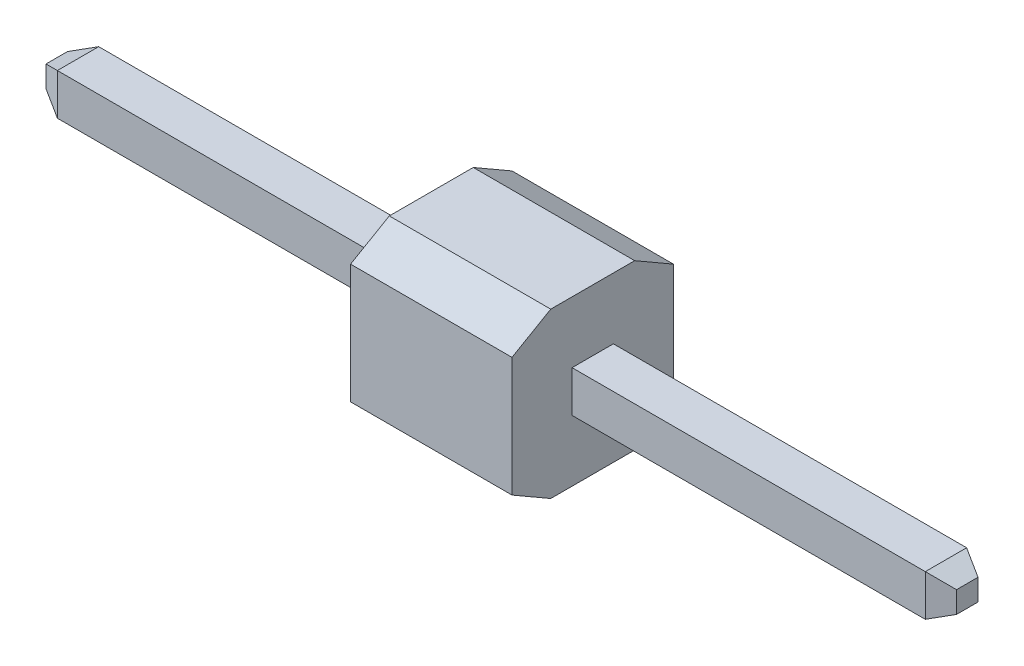
ISO-10303-21;
HEADER;
FILE_DESCRIPTION(('STEP AP214'),'2;1');
FILE_NAME('part.step','',(''),(''),'','','');
FILE_SCHEMA(('AUTOMOTIVE_DESIGN { 1 0 10303 214 1 1 1 1 }'));
ENDSEC;
DATA;
#1=APPLICATION_CONTEXT('core data for automotive mechanical design processes');
#2=APPLICATION_PROTOCOL_DEFINITION('international standard','automotive_design',2000,#1);
#3=PRODUCT_CONTEXT('',#1,'mechanical');
#4=PRODUCT('Part','Part','',(#3));
#5=PRODUCT_RELATED_PRODUCT_CATEGORY('part','',(#4));
#6=PRODUCT_DEFINITION_FORMATION('','',#4);
#7=PRODUCT_DEFINITION_CONTEXT('part definition',#1,'design');
#8=PRODUCT_DEFINITION('design','',#6,#7);
#9=PRODUCT_DEFINITION_SHAPE('','',#8);
#10=(LENGTH_UNIT() NAMED_UNIT(*) SI_UNIT(.MILLI.,.METRE.));
#11=(NAMED_UNIT(*) PLANE_ANGLE_UNIT() SI_UNIT($,.RADIAN.));
#12=(NAMED_UNIT(*) SI_UNIT($,.STERADIAN.) SOLID_ANGLE_UNIT());
#13=UNCERTAINTY_MEASURE_WITH_UNIT(LENGTH_MEASURE(1.E-05),#10,'distance_accuracy_value','');
#14=(GEOMETRIC_REPRESENTATION_CONTEXT(3) GLOBAL_UNCERTAINTY_ASSIGNED_CONTEXT((#13)) GLOBAL_UNIT_ASSIGNED_CONTEXT((#10,
#11,#12)) REPRESENTATION_CONTEXT('',''));
#15=CARTESIAN_POINT('',(0.,0.,0.));
#16=DIRECTION('',(0.,0.,1.));
#17=DIRECTION('',(1.,0.,0.));
#18=AXIS2_PLACEMENT_3D('',#15,#16,#17);
#19=CARTESIAN_POINT('',(5.42107472349216,4.76287173708609,0.629998634255617));
#20=DIRECTION('',(1.,4.37113882867379E-08,-4.37113882867379E-08));
#21=DIRECTION('',(-4.37113882867379E-08,1.,0.));
#22=AXIS2_PLACEMENT_3D('',#19,#20,#21);
#23=PLANE('',#22);
#24=DIRECTION('',(1.59994790123753E-08,0.50000000000019,0.866025403784329));
#25=VECTOR('',#24,1.);
#26=CARTESIAN_POINT('',(5.42107460050624,6.00646157557209,-0.940001365744382));
#27=LINE('',#26,#25);
#28=CARTESIAN_POINT('',(5.42107460050624,6.00646157557209,-0.940001365744382));
#29=VERTEX_POINT('',#28);
#30=CARTESIAN_POINT('',(5.421074611591,6.35287173708609,-0.340001365744383));
#31=VERTEX_POINT('',#30);
#32=EDGE_CURVE('E11',#29,#31,#27,.T.);
#33=ORIENTED_EDGE('',*,*,#32,.T.);
#34=DIRECTION('',(4.37113886966664E-08,0.,0.999999999999999));
#35=VECTOR('',#34,1.);
#36=CARTESIAN_POINT('',(5.421074611591,6.35287173708609,-0.340001365744383));
#37=LINE('',#36,#35);
#38=CARTESIAN_POINT('',(5.42107466841581,6.35287173708609,0.959998634255618));
#39=VERTEX_POINT('',#38);
#40=EDGE_CURVE('E304',#31,#39,#37,.T.);
#41=ORIENTED_EDGE('',*,*,#40,.T.);
#42=DIRECTION('',(5.97108656004285E-08,-0.500000000000189,0.866025403784328));
#43=VECTOR('',#42,1.);
#44=CARTESIAN_POINT('',(5.42107466841581,6.35287173708609,0.959998634255618));
#45=LINE('',#44,#43);
#46=CARTESIAN_POINT('',(5.42107470978471,6.00646157557209,1.55999863425562));
#47=VERTEX_POINT('',#46);
#48=EDGE_CURVE('E296',#39,#47,#45,.T.);
#49=ORIENTED_EDGE('',*,*,#48,.T.);
#50=DIRECTION('',(4.37113884815072E-08,-0.999999999999999,0.));
#51=VECTOR('',#50,1.);
#52=CARTESIAN_POINT('',(5.42107470978471,6.00646157557209,1.55999863425562));
#53=LINE('',#52,#51);
#54=CARTESIAN_POINT('',(5.4210747905275,4.15928189860009,1.55999863425562));
#55=VERTEX_POINT('',#54);
#56=EDGE_CURVE('E281',#47,#55,#53,.T.);
#57=ORIENTED_EDGE('',*,*,#56,.T.);
#58=DIRECTION('',(1.59994790123752E-08,0.500000000000192,0.866025403784328));
#59=VECTOR('',#58,1.);
#60=CARTESIAN_POINT('',(5.42107477944273,3.81287173708609,0.959998634255618));
#61=LINE('',#60,#59);
#62=CARTESIAN_POINT('',(5.42107477944273,3.81287173708609,0.959998634255618));
#63=VERTEX_POINT('',#62);
#64=EDGE_CURVE('E265',#63,#55,#61,.T.);
#65=ORIENTED_EDGE('',*,*,#64,.F.);
#66=DIRECTION('',(4.37113880134522E-08,0.,0.999999999999999));
#67=VECTOR('',#66,1.);
#68=CARTESIAN_POINT('',(5.42107472261793,3.81287173708609,-0.340001365744383));
#69=LINE('',#68,#67);
#70=CARTESIAN_POINT('',(5.42107472261793,3.81287173708609,-0.340001365744383));
#71=VERTEX_POINT('',#70);
#72=EDGE_CURVE('E248',#71,#63,#69,.T.);
#73=ORIENTED_EDGE('',*,*,#72,.F.);
#74=DIRECTION('',(5.97108668824036E-08,-0.500000000000187,0.866025403784328));
#75=VECTOR('',#74,1.);
#76=CARTESIAN_POINT('',(5.42107468124903,4.15928189860008,-0.940001365744382));
#77=LINE('',#76,#75);
#78=CARTESIAN_POINT('',(5.42107468124903,4.15928189860008,-0.940001365744382));
#79=VERTEX_POINT('',#78);
#80=EDGE_CURVE('E242',#79,#71,#77,.T.);
#81=ORIENTED_EDGE('',*,*,#80,.F.);
#82=DIRECTION('',(4.37113884815072E-08,-0.999999999999999,0.));
#83=VECTOR('',#82,1.);
#84=CARTESIAN_POINT('',(5.42107460050624,6.00646157557209,-0.940001365744382));
#85=LINE('',#84,#83);
#86=EDGE_CURVE('E236',#29,#79,#85,.T.);
#87=ORIENTED_EDGE('',*,*,#86,.F.);
#88=EDGE_LOOP('',(#33,#41,#49,#57,#65,#73,#81,#87));
#89=FACE_BOUND('',#88,.T.);
#90=DIRECTION('',(-4.37113886753159E-08,0.,-0.999999999999999));
#91=VECTOR('',#90,1.);
#92=CARTESIAN_POINT('',(5.42107469551687,5.40287173708609,0.629998634255617));
#93=LINE('',#92,#91);
#94=CARTESIAN_POINT('',(5.42107469551687,5.40287173708609,0.629998634255617));
#95=VERTEX_POINT('',#94);
#96=CARTESIAN_POINT('',(5.42107466754158,5.40287173708609,-0.0100013657443826));
#97=VERTEX_POINT('',#96);
#98=EDGE_CURVE('E302',#95,#97,#93,.T.);
#99=ORIENTED_EDGE('',*,*,#98,.T.);
#100=DIRECTION('',(-4.3711388675316E-08,0.999999999999999,0.));
#101=VECTOR('',#100,1.);
#102=CARTESIAN_POINT('',(5.42107469551687,4.76287173708609,-0.0100013657443826));
#103=LINE('',#102,#101);
#104=CARTESIAN_POINT('',(5.42107469551687,4.76287173708609,-0.0100013657443826));
#105=VERTEX_POINT('',#104);
#106=EDGE_CURVE('E293',#105,#97,#103,.T.);
#107=ORIENTED_EDGE('',*,*,#106,.F.);
#108=DIRECTION('',(-4.37113886753159E-08,0.,-0.999999999999999));
#109=VECTOR('',#108,1.);
#110=CARTESIAN_POINT('',(5.42107472349216,4.76287173708609,0.629998634255617));
#111=LINE('',#110,#109);
#112=CARTESIAN_POINT('',(5.42107472349216,4.76287173708609,0.629998634255617));
#113=VERTEX_POINT('',#112);
#114=EDGE_CURVE('E278',#113,#105,#111,.T.);
#115=ORIENTED_EDGE('',*,*,#114,.F.);
#116=DIRECTION('',(-4.3711388675316E-08,0.999999999999999,0.));
#117=VECTOR('',#116,1.);
#118=CARTESIAN_POINT('',(5.42107472349216,4.76287173708609,0.629998634255617));
#119=LINE('',#118,#117);
#120=EDGE_CURVE('E263',#113,#95,#119,.T.);
#121=ORIENTED_EDGE('',*,*,#120,.T.);
#122=EDGE_LOOP('',(#99,#107,#115,#121));
#123=FACE_BOUND('',#122,.T.);
#124=ADVANCED_FACE('F17',(#89,#123),#23,.T.);
#125=CARTESIAN_POINT('',(2.92107472349216,4.76287162780762,0.629998743534088));
#126=DIRECTION('',(1.,4.37113882867379E-08,-4.37113882867379E-08));
#127=DIRECTION('',(-4.37113882867379E-08,1.,0.));
#128=AXIS2_PLACEMENT_3D('',#125,#126,#127);
#129=PLANE('',#128);
#130=DIRECTION('',(1.59994790123753E-08,0.50000000000019,0.866025403784329));
#131=VECTOR('',#130,1.);
#132=CARTESIAN_POINT('',(2.92107460050624,6.00646146629361,-0.940001256465912));
#133=LINE('',#132,#131);
#134=CARTESIAN_POINT('',(2.92107460050624,6.00646146629361,-0.940001256465912));
#135=VERTEX_POINT('',#134);
#136=CARTESIAN_POINT('',(2.921074611591,6.35287162780762,-0.340001256465912));
#137=VERTEX_POINT('',#136);
#138=EDGE_CURVE('E24',#135,#137,#133,.T.);
#139=ORIENTED_EDGE('',*,*,#138,.F.);
#140=DIRECTION('',(4.37113884815072E-08,-0.999999999999999,0.));
#141=VECTOR('',#140,1.);
#142=CARTESIAN_POINT('',(2.92107460050624,6.00646146629361,-0.940001256465912));
#143=LINE('',#142,#141);
#144=CARTESIAN_POINT('',(2.92107468124903,4.15928178932161,-0.940001256465912));
#145=VERTEX_POINT('',#144);
#146=EDGE_CURVE('E300',#135,#145,#143,.T.);
#147=ORIENTED_EDGE('',*,*,#146,.T.);
#148=DIRECTION('',(5.97108668824036E-08,-0.500000000000187,0.866025403784328));
#149=VECTOR('',#148,1.);
#150=CARTESIAN_POINT('',(2.92107468124903,4.15928178932161,-0.940001256465912));
#151=LINE('',#150,#149);
#152=CARTESIAN_POINT('',(2.92107472261793,3.81287162780762,-0.340001256465912));
#153=VERTEX_POINT('',#152);
#154=EDGE_CURVE('E286',#145,#153,#151,.T.);
#155=ORIENTED_EDGE('',*,*,#154,.T.);
#156=DIRECTION('',(4.37113880134522E-08,0.,0.999999999999999));
#157=VECTOR('',#156,1.);
#158=CARTESIAN_POINT('',(2.92107472261793,3.81287162780762,-0.340001256465912));
#159=LINE('',#158,#157);
#160=CARTESIAN_POINT('',(2.92107477944273,3.81287162780762,0.959998743534088));
#161=VERTEX_POINT('',#160);
#162=EDGE_CURVE('E271',#153,#161,#159,.T.);
#163=ORIENTED_EDGE('',*,*,#162,.T.);
#164=DIRECTION('',(1.59994790123752E-08,0.500000000000192,0.866025403784328));
#165=VECTOR('',#164,1.);
#166=CARTESIAN_POINT('',(2.92107477944273,3.81287162780762,0.959998743534088));
#167=LINE('',#166,#165);
#168=CARTESIAN_POINT('',(2.9210747905275,4.15928178932162,1.55999874353409));
#169=VERTEX_POINT('',#168);
#170=EDGE_CURVE('E253',#161,#169,#167,.T.);
#171=ORIENTED_EDGE('',*,*,#170,.T.);
#172=DIRECTION('',(4.37113884815072E-08,-0.999999999999999,0.));
#173=VECTOR('',#172,1.);
#174=CARTESIAN_POINT('',(2.92107470978471,6.00646146629362,1.55999874353409));
#175=LINE('',#174,#173);
#176=CARTESIAN_POINT('',(2.92107470978471,6.00646146629362,1.55999874353409));
#177=VERTEX_POINT('',#176);
#178=EDGE_CURVE('E261',#177,#169,#175,.T.);
#179=ORIENTED_EDGE('',*,*,#178,.F.);
#180=DIRECTION('',(5.9710866241416E-08,-0.500000000000189,0.866025403784328));
#181=VECTOR('',#180,1.);
#182=CARTESIAN_POINT('',(2.92107466841581,6.35287162780762,0.959998743534088));
#183=LINE('',#182,#181);
#184=CARTESIAN_POINT('',(2.92107466841581,6.35287162780762,0.959998743534088));
#185=VERTEX_POINT('',#184);
#186=EDGE_CURVE('E276',#185,#177,#183,.T.);
#187=ORIENTED_EDGE('',*,*,#186,.F.);
#188=DIRECTION('',(4.37113883550593E-08,0.,0.999999999999999));
#189=VECTOR('',#188,1.);
#190=CARTESIAN_POINT('',(2.921074611591,6.35287162780762,-0.340001256465912));
#191=LINE('',#190,#189);
#192=EDGE_CURVE('E291',#137,#185,#191,.T.);
#193=ORIENTED_EDGE('',*,*,#192,.F.);
#194=EDGE_LOOP('',(#139,#147,#155,#163,#171,#179,#187,#193));
#195=FACE_BOUND('',#194,.T.);
#196=DIRECTION('',(-4.37113879814266E-08,0.999999999999999,0.));
#197=VECTOR('',#196,1.);
#198=CARTESIAN_POINT('',(2.92107469551687,4.76287162780762,-0.0100012564659119));
#199=LINE('',#198,#197);
#200=CARTESIAN_POINT('',(2.92107469551687,4.76287162780762,-0.0100012564659119));
#201=VERTEX_POINT('',#200);
#202=CARTESIAN_POINT('',(2.92107466754158,5.40287162780762,-0.0100012564659119));
#203=VERTEX_POINT('',#202);
#204=EDGE_CURVE('E298',#201,#203,#199,.T.);
#205=ORIENTED_EDGE('',*,*,#204,.T.);
#206=DIRECTION('',(-4.37113879814266E-08,0.,-0.999999999999999));
#207=VECTOR('',#206,1.);
#208=CARTESIAN_POINT('',(2.92107469551687,5.40287162780762,0.629998743534088));
#209=LINE('',#208,#207);
#210=CARTESIAN_POINT('',(2.92107469551687,5.40287162780762,0.629998743534088));
#211=VERTEX_POINT('',#210);
#212=EDGE_CURVE('E283',#211,#203,#209,.T.);
#213=ORIENTED_EDGE('',*,*,#212,.F.);
#214=DIRECTION('',(-4.3711388675316E-08,0.999999999999999,0.));
#215=VECTOR('',#214,1.);
#216=CARTESIAN_POINT('',(2.92107472349216,4.76287162780762,0.629998743534088));
#217=LINE('',#216,#215);
#218=CARTESIAN_POINT('',(2.92107472349216,4.76287162780762,0.629998743534088));
#219=VERTEX_POINT('',#218);
#220=EDGE_CURVE('E268',#219,#211,#217,.T.);
#221=ORIENTED_EDGE('',*,*,#220,.F.);
#222=DIRECTION('',(-4.37113886753159E-08,0.,-0.999999999999999));
#223=VECTOR('',#222,1.);
#224=CARTESIAN_POINT('',(2.92107472349216,4.76287162780762,0.629998743534088));
#225=LINE('',#224,#223);
#226=EDGE_CURVE('E251',#219,#201,#225,.T.);
#227=ORIENTED_EDGE('',*,*,#226,.T.);
#228=EDGE_LOOP('',(#205,#213,#221,#227));
#229=FACE_BOUND('',#228,.T.);
#230=ADVANCED_FACE('F314',(#195,#229),#129,.F.);
#231=CARTESIAN_POINT('',(5.42107460050624,6.00646157557209,-0.940001365744382));
#232=DIRECTION('',(5.97108668343731E-08,-0.866025403784328,0.50000000000019));
#233=DIRECTION('',(-1.59994785476185E-08,-0.500000000000192,-0.866025403784329));
#234=AXIS2_PLACEMENT_3D('',#231,#232,#233);
#235=PLANE('',#234);
#236=ORIENTED_EDGE('',*,*,#138,.T.);
#237=DIRECTION('',(-0.999999999999998,-4.37113886420092E-08,4.37113883755557E-08));
#238=VECTOR('',#237,1.);
#239=CARTESIAN_POINT('',(5.421074611591,6.35287173708609,-0.340001365744383));
#240=LINE('',#239,#238);
#241=EDGE_CURVE('E288',#31,#137,#240,.T.);
#242=ORIENTED_EDGE('',*,*,#241,.F.);
#243=ORIENTED_EDGE('',*,*,#32,.F.);
#244=DIRECTION('',(-0.999999999999998,-4.37113889972806E-08,4.37113881091022E-08));
#245=VECTOR('',#244,1.);
#246=CARTESIAN_POINT('',(5.42107460050624,6.00646157557209,-0.940001365744382));
#247=LINE('',#246,#245);
#248=EDGE_CURVE('E256',#29,#135,#247,.T.);
#249=ORIENTED_EDGE('',*,*,#248,.T.);
#250=EDGE_LOOP('',(#236,#242,#243,#249));
#251=FACE_BOUND('',#250,.T.);
#252=ADVANCED_FACE('F306',(#251),#235,.F.);
#253=CARTESIAN_POINT('',(5.421074611591,6.35287173708609,-0.340001365744383));
#254=DIRECTION('',(4.37113882867379E-08,-1.,0.));
#255=DIRECTION('',(1.,4.37113882867379E-08,-4.37113882867379E-08));
#256=AXIS2_PLACEMENT_3D('',#253,#254,#255);
#257=PLANE('',#256);
#258=ORIENTED_EDGE('',*,*,#192,.T.);
#259=DIRECTION('',(-0.999999999999998,-4.37113886420092E-08,4.37113882867378E-08));
#260=VECTOR('',#259,1.);
#261=CARTESIAN_POINT('',(5.42107466841581,6.35287173708609,0.959998634255618));
#262=LINE('',#261,#260);
#263=EDGE_CURVE('E273',#39,#185,#262,.T.);
#264=ORIENTED_EDGE('',*,*,#263,.F.);
#265=ORIENTED_EDGE('',*,*,#40,.F.);
#266=ORIENTED_EDGE('',*,*,#241,.T.);
#267=EDGE_LOOP('',(#258,#264,#265,#266));
#268=FACE_BOUND('',#267,.T.);
#269=ADVANCED_FACE('F311',(#268),#257,.F.);
#270=CARTESIAN_POINT('',(5.42107466841581,6.35287173708609,0.959998634255618));
#271=DIRECTION('',(1.59994785476185E-08,-0.86602540378433,-0.50000000000019));
#272=DIRECTION('',(-5.97108668343731E-08,0.500000000000188,-0.866025403784329));
#273=AXIS2_PLACEMENT_3D('',#270,#271,#272);
#274=PLANE('',#273);
#275=ORIENTED_EDGE('',*,*,#186,.T.);
#276=DIRECTION('',(-0.999999999999998,-4.37113889972806E-08,4.37113882867378E-08));
#277=VECTOR('',#276,1.);
#278=CARTESIAN_POINT('',(5.42107470978471,6.00646157557209,1.55999863425562));
#279=LINE('',#278,#277);
#280=EDGE_CURVE('E258',#47,#177,#279,.T.);
#281=ORIENTED_EDGE('',*,*,#280,.F.);
#282=ORIENTED_EDGE('',*,*,#48,.F.);
#283=ORIENTED_EDGE('',*,*,#263,.T.);
#284=EDGE_LOOP('',(#275,#281,#282,#283));
#285=FACE_BOUND('',#284,.T.);
#286=ADVANCED_FACE('F319',(#285),#274,.F.);
#287=CARTESIAN_POINT('',(5.42107470978471,6.00646157557209,1.55999863425562));
#288=DIRECTION('',(-4.37113882867379E-08,0.,-1.));
#289=DIRECTION('',(-1.,-4.37113882867379E-08,4.37113882867379E-08));
#290=AXIS2_PLACEMENT_3D('',#287,#288,#289);
#291=PLANE('',#290);
#292=ORIENTED_EDGE('',*,*,#178,.T.);
#293=DIRECTION('',(-0.999999999999998,-4.37113882867378E-08,4.37113882867378E-08));
#294=VECTOR('',#293,1.);
#295=CARTESIAN_POINT('',(5.4210747905275,4.15928189860009,1.55999863425562));
#296=LINE('',#295,#294);
#297=EDGE_CURVE('E245',#55,#169,#296,.T.);
#298=ORIENTED_EDGE('',*,*,#297,.F.);
#299=ORIENTED_EDGE('',*,*,#56,.F.);
#300=ORIENTED_EDGE('',*,*,#280,.T.);
#301=EDGE_LOOP('',(#292,#298,#299,#300));
#302=FACE_BOUND('',#301,.T.);
#303=ADVANCED_FACE('F326',(#302),#291,.F.);
#304=CARTESIAN_POINT('',(5.42107477944273,3.81287173708609,0.959998634255618));
#305=DIRECTION('',(5.97108668343731E-08,-0.866025403784328,0.50000000000019));
#306=DIRECTION('',(-1.59994785476185E-08,-0.500000000000192,-0.866025403784329));
#307=AXIS2_PLACEMENT_3D('',#304,#305,#306);
#308=PLANE('',#307);
#309=ORIENTED_EDGE('',*,*,#170,.F.);
#310=DIRECTION('',(-0.999999999999998,-4.37113882867378E-08,4.37113882867378E-08));
#311=VECTOR('',#310,1.);
#312=CARTESIAN_POINT('',(5.42107477944273,3.81287173708609,0.959998634255618));
#313=LINE('',#312,#311);
#314=EDGE_CURVE('E239',#63,#161,#313,.T.);
#315=ORIENTED_EDGE('',*,*,#314,.F.);
#316=ORIENTED_EDGE('',*,*,#64,.T.);
#317=ORIENTED_EDGE('',*,*,#297,.T.);
#318=EDGE_LOOP('',(#309,#315,#316,#317));
#319=FACE_BOUND('',#318,.T.);
#320=ADVANCED_FACE('F329',(#319),#308,.T.);
#321=CARTESIAN_POINT('',(5.42107472261793,3.81287173708609,-0.340001365744383));
#322=DIRECTION('',(4.37113882867379E-08,-1.,0.));
#323=DIRECTION('',(1.,4.37113882867379E-08,-4.37113882867379E-08));
#324=AXIS2_PLACEMENT_3D('',#321,#322,#323);
#325=PLANE('',#324);
#326=ORIENTED_EDGE('',*,*,#162,.F.);
#327=DIRECTION('',(-0.999999999999998,-4.37113882867378E-08,4.37113883755557E-08));
#328=VECTOR('',#327,1.);
#329=CARTESIAN_POINT('',(5.42107472261793,3.81287173708609,-0.340001365744383));
#330=LINE('',#329,#328);
#331=EDGE_CURVE('E233',#71,#153,#330,.T.);
#332=ORIENTED_EDGE('',*,*,#331,.F.);
#333=ORIENTED_EDGE('',*,*,#72,.T.);
#334=ORIENTED_EDGE('',*,*,#314,.T.);
#335=EDGE_LOOP('',(#326,#332,#333,#334));
#336=FACE_BOUND('',#335,.T.);
#337=ADVANCED_FACE('F333',(#336),#325,.T.);
#338=CARTESIAN_POINT('',(5.42107468124903,4.15928189860008,-0.940001365744382));
#339=DIRECTION('',(1.59994785476185E-08,-0.86602540378433,-0.50000000000019));
#340=DIRECTION('',(-5.97108668343731E-08,0.500000000000188,-0.866025403784329));
#341=AXIS2_PLACEMENT_3D('',#338,#339,#340);
#342=PLANE('',#341);
#343=ORIENTED_EDGE('',*,*,#154,.F.);
#344=DIRECTION('',(-0.999999999999998,-4.37113882867378E-08,4.37113881091022E-08));
#345=VECTOR('',#344,1.);
#346=CARTESIAN_POINT('',(5.42107468124903,4.15928189860008,-0.940001365744382));
#347=LINE('',#346,#345);
#348=EDGE_CURVE('E230',#79,#145,#347,.T.);
#349=ORIENTED_EDGE('',*,*,#348,.F.);
#350=ORIENTED_EDGE('',*,*,#80,.T.);
#351=ORIENTED_EDGE('',*,*,#331,.T.);
#352=EDGE_LOOP('',(#343,#349,#350,#351));
#353=FACE_BOUND('',#352,.T.);
#354=ADVANCED_FACE('F337',(#353),#342,.T.);
#355=CARTESIAN_POINT('',(5.42107460050624,6.00646157557209,-0.940001365744382));
#356=DIRECTION('',(-4.37113882867379E-08,0.,-1.));
#357=DIRECTION('',(-4.37113882867379E-08,1.,0.));
#358=AXIS2_PLACEMENT_3D('',#355,#356,#357);
#359=PLANE('',#358);
#360=ORIENTED_EDGE('',*,*,#146,.F.);
#361=ORIENTED_EDGE('',*,*,#248,.F.);
#362=ORIENTED_EDGE('',*,*,#86,.T.);
#363=ORIENTED_EDGE('',*,*,#348,.T.);
#364=EDGE_LOOP('',(#360,#361,#362,#363));
#365=FACE_BOUND('',#364,.T.);
#366=ADVANCED_FACE('F339',(#365),#359,.T.);
#367=CARTESIAN_POINT('',(-2.87892527650784,4.76287137428157,0.62999899706014));
#368=DIRECTION('',(-1.,-4.37113882867379E-08,4.37113882867379E-08));
#369=DIRECTION('',(4.37113882867379E-08,-1.,0.));
#370=AXIS2_PLACEMENT_3D('',#367,#368,#369);
#371=PLANE('',#370);
#372=DIRECTION('',(4.37113927480284E-08,-0.999999999999999,0.));
#373=VECTOR('',#372,1.);
#374=CARTESIAN_POINT('',(-2.87892531900567,5.24898984709056,0.14388052425114));
#375=LINE('',#374,#373);
#376=CARTESIAN_POINT('',(-2.87892531900567,5.24898984709057,0.14388052425114));
#377=VERTEX_POINT('',#376);
#378=CARTESIAN_POINT('',(-2.87892530448313,4.91675290147256,0.14388052425114));
#379=VERTEX_POINT('',#378);
#380=EDGE_CURVE('E228',#377,#379,#375,.T.);
#381=ORIENTED_EDGE('',*,*,#380,.T.);
#382=DIRECTION('',(4.37113874013716E-08,0.,0.999999999999999));
#383=VECTOR('',#382,1.);
#384=CARTESIAN_POINT('',(-2.87892530448313,4.91675290147256,0.14388052425114));
#385=LINE('',#384,#383);
#386=CARTESIAN_POINT('',(-2.8789252899606,4.91675290147257,0.47611746986914));
#387=VERTEX_POINT('',#386);
#388=EDGE_CURVE('E223',#379,#387,#385,.T.);
#389=ORIENTED_EDGE('',*,*,#388,.T.);
#390=DIRECTION('',(-4.37113900747E-08,0.999999999999999,0.));
#391=VECTOR('',#390,1.);
#392=CARTESIAN_POINT('',(-2.87892528996059,4.91675290147257,0.47611746986914));
#393=LINE('',#392,#391);
#394=CARTESIAN_POINT('',(-2.87892530448313,5.24898984709057,0.47611746986914));
#395=VERTEX_POINT('',#394);
#396=EDGE_CURVE('E215',#387,#395,#393,.T.);
#397=ORIENTED_EDGE('',*,*,#396,.T.);
#398=DIRECTION('',(-4.37113820547151E-08,0.,-0.999999999999999));
#399=VECTOR('',#398,1.);
#400=CARTESIAN_POINT('',(-2.87892530448313,5.24898984709057,0.47611746986914));
#401=LINE('',#400,#399);
#402=EDGE_CURVE('E207',#395,#377,#401,.T.);
#403=ORIENTED_EDGE('',*,*,#402,.T.);
#404=EDGE_LOOP('',(#381,#389,#397,#403));
#405=FACE_BOUND('',#404,.T.);
#406=ADVANCED_FACE('F341',(#405),#371,.T.);
#407=CARTESIAN_POINT('',(-2.87892527650784,4.76287137428157,0.62999899706014));
#408=DIRECTION('',(4.37113882867379E-08,-1.,0.));
#409=DIRECTION('',(-4.37113882867379E-08,0.,-1.));
#410=AXIS2_PLACEMENT_3D('',#407,#408,#409);
#411=PLANE('',#410);
#412=DIRECTION('',(0.999999999999998,4.37113888452998E-08,-4.37113882769955E-08));
#413=VECTOR('',#412,1.);
#414=CARTESIAN_POINT('',(-2.54892527650784,4.76287138870632,0.629998982635382));
#415=LINE('',#414,#413);
#416=CARTESIAN_POINT('',(-2.54892527650784,4.76287138870632,0.629998982635382));
#417=VERTEX_POINT('',#416);
#418=EDGE_CURVE('E225',#417,#219,#415,.T.);
#419=ORIENTED_EDGE('',*,*,#418,.F.);
#420=DIRECTION('',(-4.37113886753159E-08,0.,-0.999999999999999));
#421=VECTOR('',#420,1.);
#422=CARTESIAN_POINT('',(-2.54892527650784,4.76287138870632,0.629998982635382));
#423=LINE('',#422,#421);
#424=CARTESIAN_POINT('',(-2.54892530448313,4.76287138870632,-0.010001017364618));
#425=VERTEX_POINT('',#424);
#426=EDGE_CURVE('E217',#417,#425,#423,.T.);
#427=ORIENTED_EDGE('',*,*,#426,.T.);
#428=DIRECTION('',(0.999999999999998,4.37113888452998E-08,-4.37113882161057E-08));
#429=VECTOR('',#428,1.);
#430=CARTESIAN_POINT('',(-2.54892530448313,4.76287138870632,-0.010001017364618));
#431=LINE('',#430,#429);
#432=EDGE_CURVE('E220',#425,#201,#431,.T.);
#433=ORIENTED_EDGE('',*,*,#432,.T.);
#434=ORIENTED_EDGE('',*,*,#226,.F.);
#435=EDGE_LOOP('',(#419,#427,#433,#434));
#436=FACE_BOUND('',#435,.T.);
#437=ADVANCED_FACE('F348',(#436),#411,.T.);
#438=CARTESIAN_POINT('',(-2.87892530448313,4.76287137428156,-0.0100010029398598));
#439=DIRECTION('',(-4.37113882867379E-08,0.,-1.));
#440=DIRECTION('',(-1.,-4.37113882867379E-08,4.37113882867379E-08));
#441=AXIS2_PLACEMENT_3D('',#438,#439,#440);
#442=PLANE('',#441);
#443=ORIENTED_EDGE('',*,*,#432,.F.);
#444=DIRECTION('',(-4.3711388675316E-08,0.999999999999999,0.));
#445=VECTOR('',#444,1.);
#446=CARTESIAN_POINT('',(-2.54892530448313,4.76287138870632,-0.010001017364618));
#447=LINE('',#446,#445);
#448=CARTESIAN_POINT('',(-2.54892533245842,5.40287138870632,-0.010001017364618));
#449=VERTEX_POINT('',#448);
#450=EDGE_CURVE('E209',#425,#449,#447,.T.);
#451=ORIENTED_EDGE('',*,*,#450,.T.);
#452=DIRECTION('',(0.999999999999998,4.37113877086912E-08,-4.37113882161057E-08));
#453=VECTOR('',#452,1.);
#454=CARTESIAN_POINT('',(-2.54892533245842,5.40287138870632,-0.010001017364618));
#455=LINE('',#454,#453);
#456=EDGE_CURVE('E212',#449,#203,#455,.T.);
#457=ORIENTED_EDGE('',*,*,#456,.T.);
#458=ORIENTED_EDGE('',*,*,#204,.F.);
#459=EDGE_LOOP('',(#443,#451,#457,#458));
#460=FACE_BOUND('',#459,.T.);
#461=ADVANCED_FACE('F424',(#460),#442,.T.);
#462=CARTESIAN_POINT('',(-2.87892530448313,5.40287137428157,0.62999899706014));
#463=DIRECTION('',(4.37113882867379E-08,-1.,0.));
#464=DIRECTION('',(-4.37113882867379E-08,0.,-1.));
#465=AXIS2_PLACEMENT_3D('',#462,#463,#464);
#466=PLANE('',#465);
#467=ORIENTED_EDGE('',*,*,#456,.F.);
#468=DIRECTION('',(4.37113900630947E-08,0.,0.999999999999999));
#469=VECTOR('',#468,1.);
#470=CARTESIAN_POINT('',(-2.54892533245842,5.40287138870632,-0.010001017364618));
#471=LINE('',#470,#469);
#472=CARTESIAN_POINT('',(-2.54892530448313,5.40287138870632,0.629998982635382));
#473=VERTEX_POINT('',#472);
#474=EDGE_CURVE('E201',#449,#473,#471,.T.);
#475=ORIENTED_EDGE('',*,*,#474,.T.);
#476=DIRECTION('',(0.999999999999998,4.37113877086912E-08,-4.37113882769955E-08));
#477=VECTOR('',#476,1.);
#478=CARTESIAN_POINT('',(-2.54892530448313,5.40287138870632,0.629998982635382));
#479=LINE('',#478,#477);
#480=EDGE_CURVE('E204',#473,#211,#479,.T.);
#481=ORIENTED_EDGE('',*,*,#480,.T.);
#482=ORIENTED_EDGE('',*,*,#212,.T.);
#483=EDGE_LOOP('',(#467,#475,#481,#482));
#484=FACE_BOUND('',#483,.T.);
#485=ADVANCED_FACE('F421',(#484),#466,.F.);
#486=CARTESIAN_POINT('',(-2.87892527650784,4.76287137428157,0.62999899706014));
#487=DIRECTION('',(-4.37113882867379E-08,0.,-1.));
#488=DIRECTION('',(-1.,-4.37113882867379E-08,4.37113882867379E-08));
#489=AXIS2_PLACEMENT_3D('',#486,#487,#488);
#490=PLANE('',#489);
#491=ORIENTED_EDGE('',*,*,#480,.F.);
#492=DIRECTION('',(4.37113900630949E-08,-0.999999999999999,0.));
#493=VECTOR('',#492,1.);
#494=CARTESIAN_POINT('',(-2.54892530448313,5.40287138870632,0.629998982635382));
#495=LINE('',#494,#493);
#496=EDGE_CURVE('E196',#473,#417,#495,.T.);
#497=ORIENTED_EDGE('',*,*,#496,.T.);
#498=ORIENTED_EDGE('',*,*,#418,.T.);
#499=ORIENTED_EDGE('',*,*,#220,.T.);
#500=EDGE_LOOP('',(#491,#497,#498,#499));
#501=FACE_BOUND('',#500,.T.);
#502=ADVANCED_FACE('F376',(#501),#490,.F.);
#503=CARTESIAN_POINT('',(-2.87892527650784,4.76287137428157,0.62999899706014));
#504=DIRECTION('',(-4.37113882867379E-08,0.,-1.));
#505=DIRECTION('',(-1.,-4.37113882867379E-08,4.37113882867379E-08));
#506=AXIS2_PLACEMENT_3D('',#503,#504,#505);
#507=PLANE('',#506);
#508=DIRECTION('',(0.999999999999998,4.37113909561443E-08,-4.37113882769955E-08));
#509=VECTOR('',#508,1.);
#510=CARTESIAN_POINT('',(5.42107472349216,4.76287173708608,0.629998634255617));
#511=LINE('',#510,#509);
#512=CARTESIAN_POINT('',(10.8910747234922,4.76287197618738,0.629998395154324));
#513=VERTEX_POINT('',#512);
#514=EDGE_CURVE('E199',#113,#513,#511,.T.);
#515=ORIENTED_EDGE('',*,*,#514,.T.);
#516=DIRECTION('',(-4.37113900630947E-08,0.999999999999999,0.));
#517=VECTOR('',#516,1.);
#518=CARTESIAN_POINT('',(10.8910747234922,4.76287197618738,0.629998395154324));
#519=LINE('',#518,#517);
#520=CARTESIAN_POINT('',(10.8910746955169,5.40287197618738,0.629998395154324));
#521=VERTEX_POINT('',#520);
#522=EDGE_CURVE('E191',#513,#521,#519,.T.);
#523=ORIENTED_EDGE('',*,*,#522,.T.);
#524=DIRECTION('',(0.999999999999998,4.37113909561443E-08,-4.37113882769955E-08));
#525=VECTOR('',#524,1.);
#526=CARTESIAN_POINT('',(5.42107469551687,5.40287173708608,0.629998634255617));
#527=LINE('',#526,#525);
#528=EDGE_CURVE('E194',#95,#521,#527,.T.);
#529=ORIENTED_EDGE('',*,*,#528,.F.);
#530=ORIENTED_EDGE('',*,*,#120,.F.);
#531=EDGE_LOOP('',(#515,#523,#529,#530));
#532=FACE_BOUND('',#531,.T.);
#533=ADVANCED_FACE('F367',(#532),#507,.F.);
#534=CARTESIAN_POINT('',(-2.87892530448313,5.40287137428157,0.62999899706014));
#535=DIRECTION('',(4.37113882867379E-08,-1.,0.));
#536=DIRECTION('',(-4.37113882867379E-08,0.,-1.));
#537=AXIS2_PLACEMENT_3D('',#534,#535,#536);
#538=PLANE('',#537);
#539=ORIENTED_EDGE('',*,*,#528,.T.);
#540=DIRECTION('',(-4.37113900630947E-08,0.,-0.999999999999999));
#541=VECTOR('',#540,1.);
#542=CARTESIAN_POINT('',(10.8910746955169,5.40287197618738,0.629998395154324));
#543=LINE('',#542,#541);
#544=CARTESIAN_POINT('',(10.8910746675416,5.40287197618738,-0.0100016048456765));
#545=VERTEX_POINT('',#544);
#546=EDGE_CURVE('E186',#521,#545,#543,.T.);
#547=ORIENTED_EDGE('',*,*,#546,.T.);
#548=DIRECTION('',(0.999999999999998,4.37113909561443E-08,-4.37113881146228E-08));
#549=VECTOR('',#548,1.);
#550=CARTESIAN_POINT('',(5.42107466754158,5.40287173708608,-0.0100013657443823));
#551=LINE('',#550,#549);
#552=EDGE_CURVE('E189',#97,#545,#551,.T.);
#553=ORIENTED_EDGE('',*,*,#552,.F.);
#554=ORIENTED_EDGE('',*,*,#98,.F.);
#555=EDGE_LOOP('',(#539,#547,#553,#554));
#556=FACE_BOUND('',#555,.T.);
#557=ADVANCED_FACE('F364',(#556),#538,.F.);
#558=CARTESIAN_POINT('',(-2.87892530448313,4.76287137428156,-0.0100010029398598));
#559=DIRECTION('',(-4.37113882867379E-08,0.,-1.));
#560=DIRECTION('',(-1.,-4.37113882867379E-08,4.37113882867379E-08));
#561=AXIS2_PLACEMENT_3D('',#558,#559,#560);
#562=PLANE('',#561);
#563=ORIENTED_EDGE('',*,*,#552,.T.);
#564=DIRECTION('',(4.37113872875373E-08,-0.999999999999999,0.));
#565=VECTOR('',#564,1.);
#566=CARTESIAN_POINT('',(10.8910746675416,5.40287197618738,-0.0100016048456764));
#567=LINE('',#566,#565);
#568=CARTESIAN_POINT('',(10.8910746955169,4.76287197618738,-0.0100016048456765));
#569=VERTEX_POINT('',#568);
#570=EDGE_CURVE('E176',#545,#569,#567,.T.);
#571=ORIENTED_EDGE('',*,*,#570,.T.);
#572=DIRECTION('',(0.999999999999998,4.37113909561443E-08,-4.37113881146228E-08));
#573=VECTOR('',#572,1.);
#574=CARTESIAN_POINT('',(5.42107469551687,4.76287173708608,-0.0100013657443823));
#575=LINE('',#574,#573);
#576=EDGE_CURVE('E179',#105,#569,#575,.T.);
#577=ORIENTED_EDGE('',*,*,#576,.F.);
#578=ORIENTED_EDGE('',*,*,#106,.T.);
#579=EDGE_LOOP('',(#563,#571,#577,#578));
#580=FACE_BOUND('',#579,.T.);
#581=ADVANCED_FACE('F366',(#580),#562,.T.);
#582=CARTESIAN_POINT('',(-2.87892527650784,4.76287137428157,0.62999899706014));
#583=DIRECTION('',(4.37113882867379E-08,-1.,0.));
#584=DIRECTION('',(-4.37113882867379E-08,0.,-1.));
#585=AXIS2_PLACEMENT_3D('',#582,#583,#584);
#586=PLANE('',#585);
#587=ORIENTED_EDGE('',*,*,#576,.T.);
#588=DIRECTION('',(4.37113900630947E-08,0.,0.999999999999999));
#589=VECTOR('',#588,1.);
#590=CARTESIAN_POINT('',(10.8910746955169,4.76287197618738,-0.0100016048456765));
#591=LINE('',#590,#589);
#592=EDGE_CURVE('E167',#569,#513,#591,.T.);
#593=ORIENTED_EDGE('',*,*,#592,.T.);
#594=ORIENTED_EDGE('',*,*,#514,.F.);
#595=ORIENTED_EDGE('',*,*,#114,.T.);
#596=EDGE_LOOP('',(#587,#593,#594,#595));
#597=FACE_BOUND('',#596,.T.);
#598=ADVANCED_FACE('F373',(#597),#586,.T.);
#599=CARTESIAN_POINT('',(11.2210747234922,4.76287199061214,0.629998380729565));
#600=DIRECTION('',(-1.,-4.37113882867379E-08,4.37113882867379E-08));
#601=DIRECTION('',(4.37113882867379E-08,-1.,0.));
#602=AXIS2_PLACEMENT_3D('',#599,#600,#601);
#603=PLANE('',#602);
#604=DIRECTION('',(-4.37113927480283E-08,0.999999999999999,0.));
#605=VECTOR('',#604,1.);
#606=CARTESIAN_POINT('',(11.2210746955169,4.91675351780314,0.143879907920565));
#607=LINE('',#606,#605);
#608=CARTESIAN_POINT('',(11.2210746955169,4.91675351780314,0.143879907920565));
#609=VERTEX_POINT('',#608);
#610=CARTESIAN_POINT('',(11.2210746809943,5.24899046342114,0.143879907920565));
#611=VERTEX_POINT('',#610);
#612=EDGE_CURVE('E153',#609,#611,#607,.T.);
#613=ORIENTED_EDGE('',*,*,#612,.T.);
#614=DIRECTION('',(4.37113927480282E-08,0.,0.999999999999999));
#615=VECTOR('',#614,1.);
#616=CARTESIAN_POINT('',(11.2210746809943,5.24899046342114,0.143879907920565));
#617=LINE('',#616,#615);
#618=CARTESIAN_POINT('',(11.2210746955169,5.24899046342114,0.476116853538565));
#619=VERTEX_POINT('',#618);
#620=EDGE_CURVE('E395',#611,#619,#617,.T.);
#621=ORIENTED_EDGE('',*,*,#620,.T.);
#622=DIRECTION('',(4.37113820547153E-08,-0.999999999999999,0.));
#623=VECTOR('',#622,1.);
#624=CARTESIAN_POINT('',(11.2210746955169,5.24899046342114,0.476116853538565));
#625=LINE('',#624,#623);
#626=CARTESIAN_POINT('',(11.2210747100394,4.91675351780314,0.476116853538565));
#627=VERTEX_POINT('',#626);
#628=EDGE_CURVE('E156',#619,#627,#625,.T.);
#629=ORIENTED_EDGE('',*,*,#628,.T.);
#630=DIRECTION('',(-4.37113927480282E-08,0.,-0.999999999999999));
#631=VECTOR('',#630,1.);
#632=CARTESIAN_POINT('',(11.2210747100394,4.91675351780314,0.476116853538565));
#633=LINE('',#632,#631);
#634=EDGE_CURVE('E149',#627,#609,#633,.T.);
#635=ORIENTED_EDGE('',*,*,#634,.T.);
#636=EDGE_LOOP('',(#613,#621,#629,#635));
#637=FACE_BOUND('',#636,.T.);
#638=ADVANCED_FACE('F151',(#637),#603,.F.);
#639=CARTESIAN_POINT('',(-2.87892529775676,5.24898984709057,0.62999899706014));
#640=DIRECTION('',(-0.422618301356784,0.906307768563367,1.84732310895534E-08));
#641=DIRECTION('',(4.37113882867379E-08,0.,1.));
#642=AXIS2_PLACEMENT_3D('',#639,#640,#641);
#643=PLANE('',#642);
#644=DIRECTION('',(0.834817095446926,0.389281657126018,-0.389281657126018));
#645=VECTOR('',#644,1.);
#646=CARTESIAN_POINT('',(-2.87892531900536,5.24898984709023,0.143880524251471));
#647=LINE('',#646,#645);
#648=EDGE_CURVE('E181',#377,#449,#647,.T.);
#649=ORIENTED_EDGE('',*,*,#648,.F.);
#650=ORIENTED_EDGE('',*,*,#402,.F.);
#651=DIRECTION('',(-0.834817129479009,-0.389281657126013,-0.389281584143988));
#652=VECTOR('',#651,1.);
#653=CARTESIAN_POINT('',(-2.54892530448291,5.40287138870609,0.629998982635147));
#654=LINE('',#653,#652);
#655=EDGE_CURVE('E404',#473,#395,#654,.T.);
#656=ORIENTED_EDGE('',*,*,#655,.F.);
#657=ORIENTED_EDGE('',*,*,#474,.F.);
#658=EDGE_LOOP('',(#649,#650,#656,#657));
#659=FACE_BOUND('',#658,.T.);
#660=ADVANCED_FACE('F418',(#659),#643,.T.);
#661=CARTESIAN_POINT('',(-2.87892528323422,4.76287137428157,0.47611746986914));
#662=DIRECTION('',(-0.422618222124841,-1.84732292043498E-08,0.906307805509828));
#663=DIRECTION('',(4.37113882867379E-08,-1.,0.));
#664=AXIS2_PLACEMENT_3D('',#661,#662,#663);
#665=PLANE('',#664);
#666=ORIENTED_EDGE('',*,*,#655,.T.);
#667=ORIENTED_EDGE('',*,*,#396,.F.);
#668=DIRECTION('',(-0.834817163511087,0.389281584143987,-0.389281584143986));
#669=VECTOR('',#668,1.);
#670=CARTESIAN_POINT('',(-2.54892527650767,4.76287138870651,0.629998982635199));
#671=LINE('',#670,#669);
#672=EDGE_CURVE('E160',#417,#387,#671,.T.);
#673=ORIENTED_EDGE('',*,*,#672,.F.);
#674=ORIENTED_EDGE('',*,*,#496,.F.);
#675=EDGE_LOOP('',(#666,#667,#673,#674));
#676=FACE_BOUND('',#675,.T.);
#677=ADVANCED_FACE('F434',(#676),#665,.T.);
#678=CARTESIAN_POINT('',(-2.54892530448313,4.76287138870632,-0.010001017364618));
#679=DIRECTION('',(0.422618301356784,1.8473232667688E-08,0.906307768563367));
#680=DIRECTION('',(-4.37113882867379E-08,1.,0.));
#681=AXIS2_PLACEMENT_3D('',#678,#679,#680);
#682=PLANE('',#681);
#683=ORIENTED_EDGE('',*,*,#648,.T.);
#684=ORIENTED_EDGE('',*,*,#450,.F.);
#685=DIRECTION('',(0.834817129479005,-0.389281584143992,-0.389281657126018));
#686=VECTOR('',#685,1.);
#687=CARTESIAN_POINT('',(-2.87892530448304,4.91675290147266,0.143880524251236));
#688=LINE('',#687,#686);
#689=EDGE_CURVE('E170',#379,#425,#688,.T.);
#690=ORIENTED_EDGE('',*,*,#689,.F.);
#691=ORIENTED_EDGE('',*,*,#380,.F.);
#692=EDGE_LOOP('',(#683,#684,#690,#691));
#693=FACE_BOUND('',#692,.T.);
#694=ADVANCED_FACE('F413',(#693),#682,.F.);
#695=CARTESIAN_POINT('',(-2.54892527650784,4.76287138870632,0.629998982635382));
#696=DIRECTION('',(0.422618222124841,0.906307805509828,-1.84732308250282E-08));
#697=DIRECTION('',(-4.37113882867379E-08,0.,-1.));
#698=AXIS2_PLACEMENT_3D('',#695,#696,#697);
#699=PLANE('',#698);
#700=ORIENTED_EDGE('',*,*,#672,.T.);
#701=ORIENTED_EDGE('',*,*,#388,.F.);
#702=ORIENTED_EDGE('',*,*,#689,.T.);
#703=ORIENTED_EDGE('',*,*,#426,.F.);
#704=EDGE_LOOP('',(#700,#701,#702,#703));
#705=FACE_BOUND('',#704,.T.);
#706=ADVANCED_FACE('F429',(#705),#699,.F.);
#707=CARTESIAN_POINT('',(11.2210747167658,4.91675351780314,0.629998380729565));
#708=DIRECTION('',(0.422618301356784,-0.906307768563367,-1.84732310470096E-08));
#709=DIRECTION('',(4.37113882867379E-08,0.,1.));
#710=AXIS2_PLACEMENT_3D('',#707,#708,#709);
#711=PLANE('',#710);
#712=DIRECTION('',(-0.834817129479008,-0.389281657126016,-0.389281584143986));
#713=VECTOR('',#712,1.);
#714=CARTESIAN_POINT('',(11.2210746955166,4.91675351780347,0.143879907920896));
#715=LINE('',#714,#713);
#716=EDGE_CURVE('E164',#609,#569,#715,.T.);
#717=ORIENTED_EDGE('',*,*,#716,.F.);
#718=ORIENTED_EDGE('',*,*,#634,.F.);
#719=DIRECTION('',(0.834817095446927,0.389281657126015,-0.389281657126019));
#720=VECTOR('',#719,1.);
#721=CARTESIAN_POINT('',(10.8910747234922,4.76287197618738,0.629998395154324));
#722=LINE('',#721,#720);
#723=EDGE_CURVE('E392',#513,#627,#722,.T.);
#724=ORIENTED_EDGE('',*,*,#723,.F.);
#725=ORIENTED_EDGE('',*,*,#592,.F.);
#726=EDGE_LOOP('',(#717,#718,#724,#725));
#727=FACE_BOUND('',#726,.T.);
#728=ADVANCED_FACE('F165',(#727),#711,.T.);
#729=CARTESIAN_POINT('',(10.8910747234922,4.76287197618738,0.629998395154324));
#730=DIRECTION('',(-0.422618301356784,-1.8473232667688E-08,-0.906307768563367));
#731=DIRECTION('',(-4.37113882867379E-08,1.,0.));
#732=AXIS2_PLACEMENT_3D('',#729,#730,#731);
#733=PLANE('',#732);
#734=ORIENTED_EDGE('',*,*,#723,.T.);
#735=ORIENTED_EDGE('',*,*,#628,.F.);
#736=DIRECTION('',(0.834817129479008,-0.389281584143984,-0.389281657126018));
#737=VECTOR('',#736,1.);
#738=CARTESIAN_POINT('',(10.8910746955168,5.40287197618735,0.629998395154179));
#739=LINE('',#738,#737);
#740=EDGE_CURVE('E389',#521,#619,#739,.T.);
#741=ORIENTED_EDGE('',*,*,#740,.F.);
#742=ORIENTED_EDGE('',*,*,#522,.F.);
#743=EDGE_LOOP('',(#734,#735,#741,#742));
#744=FACE_BOUND('',#743,.T.);
#745=ADVANCED_FACE('F390',(#744),#733,.F.);
#746=CARTESIAN_POINT('',(11.2210747022432,4.76287199061214,0.143879907920565));
#747=DIRECTION('',(0.422618222124841,1.84732292043498E-08,-0.906307805509828));
#748=DIRECTION('',(4.37113882867379E-08,-1.,0.));
#749=AXIS2_PLACEMENT_3D('',#746,#747,#748);
#750=PLANE('',#749);
#751=ORIENTED_EDGE('',*,*,#716,.T.);
#752=ORIENTED_EDGE('',*,*,#570,.F.);
#753=DIRECTION('',(-0.834817163511086,0.389281584143988,-0.389281584143987));
#754=VECTOR('',#753,1.);
#755=CARTESIAN_POINT('',(11.221074680994,5.24899046342081,0.143879907920896));
#756=LINE('',#755,#754);
#757=EDGE_CURVE('E175',#611,#545,#756,.T.);
#758=ORIENTED_EDGE('',*,*,#757,.F.);
#759=ORIENTED_EDGE('',*,*,#612,.F.);
#760=EDGE_LOOP('',(#751,#752,#758,#759));
#761=FACE_BOUND('',#760,.T.);
#762=ADVANCED_FACE('F173',(#761),#750,.T.);
#763=CARTESIAN_POINT('',(10.8910746955169,5.40287197618738,0.629998395154324));
#764=DIRECTION('',(-0.422618222124841,-0.906307805509828,1.84732307824844E-08));
#765=DIRECTION('',(-4.37113882867379E-08,0.,-1.));
#766=AXIS2_PLACEMENT_3D('',#763,#764,#765);
#767=PLANE('',#766);
#768=ORIENTED_EDGE('',*,*,#740,.T.);
#769=ORIENTED_EDGE('',*,*,#620,.F.);
#770=ORIENTED_EDGE('',*,*,#757,.T.);
#771=ORIENTED_EDGE('',*,*,#546,.F.);
#772=EDGE_LOOP('',(#768,#769,#770,#771));
#773=FACE_BOUND('',#772,.T.);
#774=ADVANCED_FACE('F394',(#773),#767,.F.);
#775=CLOSED_SHELL('',(#124,#230,#252,#269,#286,#303,#320,#337,#354,#366,#406,#437,#461,#485,
#502,#533,#557,#581,#598,#638,#660,#677,#694,#706,#728,#745,#762,#774));
#776=MANIFOLD_SOLID_BREP('B1',#775);
#777=ADVANCED_BREP_SHAPE_REPRESENTATION('',(#18,#776),#14);
#778=SHAPE_DEFINITION_REPRESENTATION(#9,#777);
ENDSEC;
END-ISO-10303-21;
